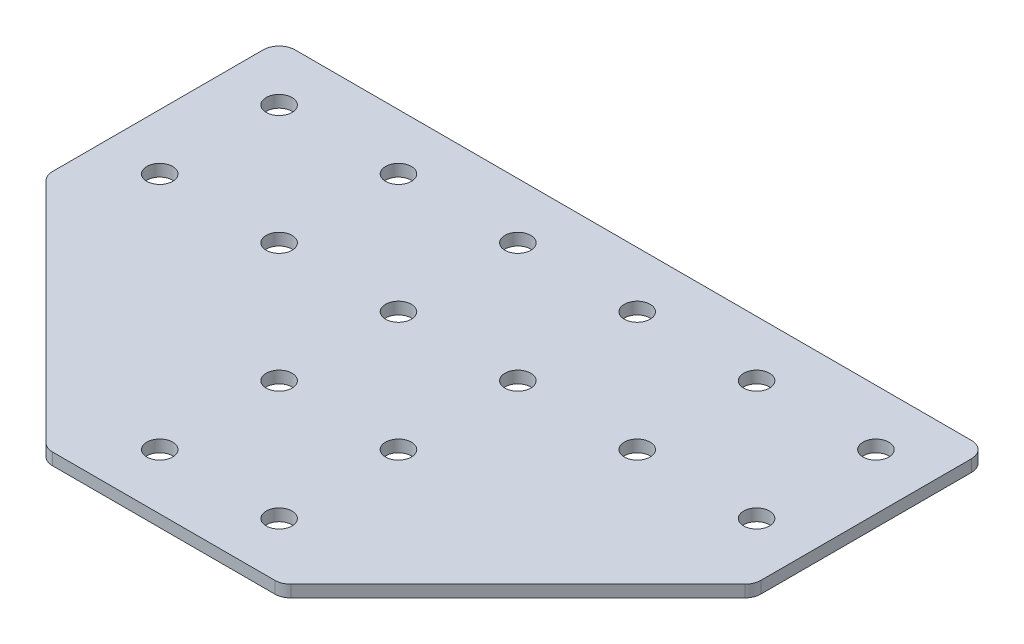
ISO-10303-21;
HEADER;
FILE_DESCRIPTION(('STEP AP214'),'2;1');
FILE_NAME('part.step','',(''),(''),'','','');
FILE_SCHEMA(('AUTOMOTIVE_DESIGN { 1 0 10303 214 1 1 1 1 }'));
ENDSEC;
DATA;
#1=APPLICATION_CONTEXT('core data for automotive mechanical design processes');
#2=APPLICATION_PROTOCOL_DEFINITION('international standard','automotive_design',2000,#1);
#3=PRODUCT_CONTEXT('',#1,'mechanical');
#4=PRODUCT('Part','Part','',(#3));
#5=PRODUCT_RELATED_PRODUCT_CATEGORY('part','',(#4));
#6=PRODUCT_DEFINITION_FORMATION('','',#4);
#7=PRODUCT_DEFINITION_CONTEXT('part definition',#1,'design');
#8=PRODUCT_DEFINITION('design','',#6,#7);
#9=PRODUCT_DEFINITION_SHAPE('','',#8);
#10=(LENGTH_UNIT() NAMED_UNIT(*) SI_UNIT(.MILLI.,.METRE.));
#11=(NAMED_UNIT(*) PLANE_ANGLE_UNIT() SI_UNIT($,.RADIAN.));
#12=(NAMED_UNIT(*) SI_UNIT($,.STERADIAN.) SOLID_ANGLE_UNIT());
#13=UNCERTAINTY_MEASURE_WITH_UNIT(LENGTH_MEASURE(1.E-05),#10,'distance_accuracy_value','');
#14=(GEOMETRIC_REPRESENTATION_CONTEXT(3) GLOBAL_UNCERTAINTY_ASSIGNED_CONTEXT((#13)) GLOBAL_UNIT_ASSIGNED_CONTEXT((#10,
#11,#12)) REPRESENTATION_CONTEXT('',''));
#15=CARTESIAN_POINT('',(0.,0.,0.));
#16=DIRECTION('',(0.,0.,1.));
#17=DIRECTION('',(1.,0.,0.));
#18=AXIS2_PLACEMENT_3D('',#15,#16,#17);
#19=CARTESIAN_POINT('',(-1.34521083117534,1.74134831028641,-16.1457325979904));
#20=DIRECTION('',(0.,-1.,0.));
#21=DIRECTION('',(0.,0.,-1.));
#22=AXIS2_PLACEMENT_3D('',#19,#20,#21);
#23=PLANE('',#22);
#24=DIRECTION('',(1.,0.,0.));
#25=VECTOR('',#24,1.);
#26=CARTESIAN_POINT('',(-15.8452108311755,1.74134831028641,28.3542674020096));
#27=LINE('',#26,#25);
#28=CARTESIAN_POINT('',(-15.3096769252427,1.74134831028641,28.3542674020096));
#29=VERTEX_POINT('',#28);
#30=CARTESIAN_POINT('',(12.619255262892,1.74134831028641,28.3542674020096));
#31=VERTEX_POINT('',#30);
#32=EDGE_CURVE('E218',#29,#31,#27,.T.);
#33=ORIENTED_EDGE('',*,*,#32,.F.);
#34=CARTESIAN_POINT('',(-15.3096769252427,1.74134831028641,26.3542674020096));
#35=DIRECTION('',(0.,1.,0.));
#36=DIRECTION('',(0.,0.,-1.));
#37=AXIS2_PLACEMENT_3D('',#34,#35,#36);
#38=CIRCLE('',#37,2.);
#39=CARTESIAN_POINT('',(-16.7238904876158,1.74134831028641,27.7684809643826));
#40=VERTEX_POINT('',#39);
#41=EDGE_CURVE('E154',#40,#29,#38,.T.);
#42=ORIENTED_EDGE('',*,*,#41,.F.);
#43=DIRECTION('',(-0.707106781186546,0.,-0.707106781186549));
#44=VECTOR('',#43,1.);
#45=CARTESIAN_POINT('',(-16.1381040499889,1.74134831028641,28.3542674020096));
#46=LINE('',#45,#44);
#47=CARTESIAN_POINT('',(-45.2594243935483,1.74134831028641,-0.767052941549988));
#48=VERTEX_POINT('',#47);
#49=EDGE_CURVE('E141',#40,#48,#46,.T.);
#50=ORIENTED_EDGE('',*,*,#49,.T.);
#51=CARTESIAN_POINT('',(-43.8452108311752,1.74134831028641,-2.18126650392308));
#52=DIRECTION('',(0.,1.,0.));
#53=DIRECTION('',(0.,0.,-1.));
#54=AXIS2_PLACEMENT_3D('',#51,#52,#53);
#55=CIRCLE('',#54,2.);
#56=CARTESIAN_POINT('',(-45.8452108311752,1.74134831028641,-2.18126650392308));
#57=VERTEX_POINT('',#56);
#58=EDGE_CURVE('E152',#57,#48,#55,.T.);
#59=ORIENTED_EDGE('',*,*,#58,.F.);
#60=DIRECTION('',(0.,0.,-1.));
#61=VECTOR('',#60,1.);
#62=CARTESIAN_POINT('',(-45.8452108311752,1.74134831028641,-1.3528393791769));
#63=LINE('',#62,#61);
#64=CARTESIAN_POINT('',(-45.8452108311752,1.74134831028641,-28.6457325979904));
#65=VERTEX_POINT('',#64);
#66=EDGE_CURVE('E124',#57,#65,#63,.T.);
#67=ORIENTED_EDGE('',*,*,#66,.T.);
#68=CARTESIAN_POINT('',(-43.8452108311752,1.74134831028641,-28.6457325979904));
#69=DIRECTION('',(0.,1.,0.));
#70=DIRECTION('',(0.,0.,-1.));
#71=AXIS2_PLACEMENT_3D('',#68,#69,#70);
#72=CIRCLE('',#71,2.);
#73=CARTESIAN_POINT('',(-43.8452108311752,1.74134831028641,-30.6457325979904));
#74=VERTEX_POINT('',#73);
#75=EDGE_CURVE('E149',#74,#65,#72,.T.);
#76=ORIENTED_EDGE('',*,*,#75,.F.);
#77=DIRECTION('',(-1.,0.,0.));
#78=VECTOR('',#77,1.);
#79=CARTESIAN_POINT('',(43.1547891688245,1.74134831028641,-30.6457325979904));
#80=LINE('',#79,#78);
#81=CARTESIAN_POINT('',(41.1547891688245,1.74134831028641,-30.6457325979904));
#82=VERTEX_POINT('',#81);
#83=EDGE_CURVE('E215',#82,#74,#80,.T.);
#84=ORIENTED_EDGE('',*,*,#83,.F.);
#85=CARTESIAN_POINT('',(41.1547891688245,1.74134831028641,-28.6457325979904));
#86=DIRECTION('',(0.,-1.,0.));
#87=DIRECTION('',(0.,0.,-1.));
#88=AXIS2_PLACEMENT_3D('',#85,#86,#87);
#89=CIRCLE('',#88,2.);
#90=CARTESIAN_POINT('',(43.1547891688245,1.74134831028641,-28.6457325979904));
#91=VERTEX_POINT('',#90);
#92=EDGE_CURVE('E239',#82,#91,#89,.T.);
#93=ORIENTED_EDGE('',*,*,#92,.T.);
#94=DIRECTION('',(0.,0.,-1.));
#95=VECTOR('',#94,1.);
#96=CARTESIAN_POINT('',(43.1547891688245,1.74134831028641,-1.35283937917691));
#97=LINE('',#96,#95);
#98=CARTESIAN_POINT('',(43.1547891688245,1.74134831028641,-2.18126650392309));
#99=VERTEX_POINT('',#98);
#100=EDGE_CURVE('E212',#99,#91,#97,.T.);
#101=ORIENTED_EDGE('',*,*,#100,.F.);
#102=CARTESIAN_POINT('',(41.1547891688245,1.74134831028641,-2.18126650392309));
#103=DIRECTION('',(0.,-1.,0.));
#104=DIRECTION('',(0.,0.,-1.));
#105=AXIS2_PLACEMENT_3D('',#102,#103,#104);
#106=CIRCLE('',#105,2.);
#107=CARTESIAN_POINT('',(42.5690027311976,1.74134831028641,-0.767052941549998));
#108=VERTEX_POINT('',#107);
#109=EDGE_CURVE('E31',#99,#108,#106,.T.);
#110=ORIENTED_EDGE('',*,*,#109,.T.);
#111=DIRECTION('',(0.707106781186546,0.,-0.707106781186549));
#112=VECTOR('',#111,1.);
#113=CARTESIAN_POINT('',(13.4476823876382,1.74134831028641,28.3542674020096));
#114=LINE('',#113,#112);
#115=CARTESIAN_POINT('',(14.0334688252651,1.74134831028641,27.7684809643826));
#116=VERTEX_POINT('',#115);
#117=EDGE_CURVE('E220',#116,#108,#114,.T.);
#118=ORIENTED_EDGE('',*,*,#117,.F.);
#119=CARTESIAN_POINT('',(12.619255262892,1.74134831028641,26.3542674020096));
#120=DIRECTION('',(0.,-1.,0.));
#121=DIRECTION('',(0.,0.,-1.));
#122=AXIS2_PLACEMENT_3D('',#119,#120,#121);
#123=CIRCLE('',#122,2.);
#124=EDGE_CURVE('E242',#116,#31,#123,.T.);
#125=ORIENTED_EDGE('',*,*,#124,.T.);
#126=EDGE_LOOP('',(#33,#42,#50,#59,#67,#76,#84,#93,#101,#110,#118,#125));
#127=FACE_BOUND('',#126,.T.);
#128=CARTESIAN_POINT('',(36.1547891688246,1.74134831028641,-8.64573259799041));
#129=DIRECTION('',(0.,1.,0.));
#130=DIRECTION('',(0.,0.,1.));
#131=AXIS2_PLACEMENT_3D('',#128,#129,#130);
#132=CIRCLE('',#131,1.625);
#133=CARTESIAN_POINT('',(36.1547891688246,1.74134831028641,-7.02073259799041));
#134=VERTEX_POINT('',#133);
#135=EDGE_CURVE('E164',#134,#134,#132,.T.);
#136=ORIENTED_EDGE('',*,*,#135,.T.);
#137=EDGE_LOOP('',(#136));
#138=FACE_BOUND('',#137,.T.);
#139=CARTESIAN_POINT('',(21.1547891688246,1.74134831028641,-8.64573259799039));
#140=DIRECTION('',(0.,1.,0.));
#141=DIRECTION('',(0.,0.,1.));
#142=AXIS2_PLACEMENT_3D('',#139,#140,#141);
#143=CIRCLE('',#142,1.625);
#144=CARTESIAN_POINT('',(21.1547891688246,1.74134831028641,-7.02073259799039));
#145=VERTEX_POINT('',#144);
#146=EDGE_CURVE('E170',#145,#145,#143,.T.);
#147=ORIENTED_EDGE('',*,*,#146,.T.);
#148=EDGE_LOOP('',(#147));
#149=FACE_BOUND('',#148,.T.);
#150=CARTESIAN_POINT('',(6.15478916882467,1.74134831028641,21.3542674020096));
#151=DIRECTION('',(0.,1.,0.));
#152=DIRECTION('',(0.,0.,1.));
#153=AXIS2_PLACEMENT_3D('',#150,#151,#152);
#154=CIRCLE('',#153,1.625);
#155=CARTESIAN_POINT('',(6.15478916882467,1.74134831028641,22.9792674020096));
#156=VERTEX_POINT('',#155);
#157=EDGE_CURVE('E176',#156,#156,#154,.T.);
#158=ORIENTED_EDGE('',*,*,#157,.T.);
#159=EDGE_LOOP('',(#158));
#160=FACE_BOUND('',#159,.T.);
#161=CARTESIAN_POINT('',(6.15478916882467,1.74134831028641,6.3542674020096));
#162=DIRECTION('',(0.,1.,0.));
#163=DIRECTION('',(0.,0.,1.));
#164=AXIS2_PLACEMENT_3D('',#161,#162,#163);
#165=CIRCLE('',#164,1.625);
#166=CARTESIAN_POINT('',(6.15478916882467,1.74134831028641,7.9792674020096));
#167=VERTEX_POINT('',#166);
#168=EDGE_CURVE('E182',#167,#167,#165,.T.);
#169=ORIENTED_EDGE('',*,*,#168,.T.);
#170=EDGE_LOOP('',(#169));
#171=FACE_BOUND('',#170,.T.);
#172=CARTESIAN_POINT('',(6.15478916882464,1.74134831028641,-8.6457325979904));
#173=DIRECTION('',(0.,1.,0.));
#174=DIRECTION('',(0.,0.,1.));
#175=AXIS2_PLACEMENT_3D('',#172,#173,#174);
#176=CIRCLE('',#175,1.625);
#177=CARTESIAN_POINT('',(6.15478916882464,1.74134831028641,-7.02073259799039));
#178=VERTEX_POINT('',#177);
#179=EDGE_CURVE('E188',#178,#178,#176,.T.);
#180=ORIENTED_EDGE('',*,*,#179,.T.);
#181=EDGE_LOOP('',(#180));
#182=FACE_BOUND('',#181,.T.);
#183=CARTESIAN_POINT('',(36.1547891688246,1.74134831028641,-23.6457325979904));
#184=DIRECTION('',(0.,1.,0.));
#185=DIRECTION('',(0.,0.,1.));
#186=AXIS2_PLACEMENT_3D('',#183,#184,#185);
#187=CIRCLE('',#186,1.625);
#188=CARTESIAN_POINT('',(36.1547891688246,1.74134831028641,-22.0207325979904));
#189=VERTEX_POINT('',#188);
#190=EDGE_CURVE('E194',#189,#189,#187,.T.);
#191=ORIENTED_EDGE('',*,*,#190,.T.);
#192=EDGE_LOOP('',(#191));
#193=FACE_BOUND('',#192,.T.);
#194=CARTESIAN_POINT('',(21.1547891688246,1.74134831028641,-23.6457325979904));
#195=DIRECTION('',(0.,1.,0.));
#196=DIRECTION('',(0.,0.,1.));
#197=AXIS2_PLACEMENT_3D('',#194,#195,#196);
#198=CIRCLE('',#197,1.625);
#199=CARTESIAN_POINT('',(21.1547891688246,1.74134831028641,-22.0207325979904));
#200=VERTEX_POINT('',#199);
#201=EDGE_CURVE('E200',#200,#200,#198,.T.);
#202=ORIENTED_EDGE('',*,*,#201,.T.);
#203=EDGE_LOOP('',(#202));
#204=FACE_BOUND('',#203,.T.);
#205=CARTESIAN_POINT('',(6.15478916882464,1.74134831028641,-23.6457325979904));
#206=DIRECTION('',(0.,1.,0.));
#207=DIRECTION('',(0.,0.,1.));
#208=AXIS2_PLACEMENT_3D('',#205,#206,#207);
#209=CIRCLE('',#208,1.625);
#210=CARTESIAN_POINT('',(6.15478916882464,1.74134831028641,-22.0207325979904));
#211=VERTEX_POINT('',#210);
#212=EDGE_CURVE('E206',#211,#211,#209,.T.);
#213=ORIENTED_EDGE('',*,*,#212,.T.);
#214=EDGE_LOOP('',(#213));
#215=FACE_BOUND('',#214,.T.);
#216=CARTESIAN_POINT('',(-38.8452108311753,1.74134831028641,-8.6457325979904));
#217=DIRECTION('',(0.,-1.,0.));
#218=DIRECTION('',(0.,0.,1.));
#219=AXIS2_PLACEMENT_3D('',#216,#217,#218);
#220=CIRCLE('',#219,1.625);
#221=CARTESIAN_POINT('',(-38.8452108311753,1.74134831028641,-7.0207325979904));
#222=VERTEX_POINT('',#221);
#223=EDGE_CURVE('E318',#222,#222,#220,.T.);
#224=ORIENTED_EDGE('',*,*,#223,.F.);
#225=EDGE_LOOP('',(#224));
#226=FACE_BOUND('',#225,.T.);
#227=CARTESIAN_POINT('',(-23.8452108311753,1.74134831028641,-8.64573259799039));
#228=DIRECTION('',(0.,-1.,0.));
#229=DIRECTION('',(0.,0.,1.));
#230=AXIS2_PLACEMENT_3D('',#227,#228,#229);
#231=CIRCLE('',#230,1.625);
#232=CARTESIAN_POINT('',(-23.8452108311753,1.74134831028641,-7.02073259799039));
#233=VERTEX_POINT('',#232);
#234=EDGE_CURVE('E312',#233,#233,#231,.T.);
#235=ORIENTED_EDGE('',*,*,#234,.F.);
#236=EDGE_LOOP('',(#235));
#237=FACE_BOUND('',#236,.T.);
#238=CARTESIAN_POINT('',(-8.84521083117533,1.74134831028641,21.3542674020096));
#239=DIRECTION('',(0.,-1.,0.));
#240=DIRECTION('',(0.,0.,1.));
#241=AXIS2_PLACEMENT_3D('',#238,#239,#240);
#242=CIRCLE('',#241,1.625);
#243=CARTESIAN_POINT('',(-8.84521083117533,1.74134831028641,22.9792674020096));
#244=VERTEX_POINT('',#243);
#245=EDGE_CURVE('E306',#244,#244,#242,.T.);
#246=ORIENTED_EDGE('',*,*,#245,.F.);
#247=EDGE_LOOP('',(#246));
#248=FACE_BOUND('',#247,.T.);
#249=CARTESIAN_POINT('',(-8.84521083117533,1.74134831028641,6.3542674020096));
#250=DIRECTION('',(0.,-1.,0.));
#251=DIRECTION('',(0.,0.,1.));
#252=AXIS2_PLACEMENT_3D('',#249,#250,#251);
#253=CIRCLE('',#252,1.625);
#254=CARTESIAN_POINT('',(-8.84521083117533,1.74134831028641,7.9792674020096));
#255=VERTEX_POINT('',#254);
#256=EDGE_CURVE('E300',#255,#255,#253,.T.);
#257=ORIENTED_EDGE('',*,*,#256,.F.);
#258=EDGE_LOOP('',(#257));
#259=FACE_BOUND('',#258,.T.);
#260=CARTESIAN_POINT('',(-8.84521083117531,1.74134831028641,-8.64573259799039));
#261=DIRECTION('',(0.,-1.,0.));
#262=DIRECTION('',(0.,0.,1.));
#263=AXIS2_PLACEMENT_3D('',#260,#261,#262);
#264=CIRCLE('',#263,1.625);
#265=CARTESIAN_POINT('',(-8.84521083117531,1.74134831028641,-7.02073259799039));
#266=VERTEX_POINT('',#265);
#267=EDGE_CURVE('E294',#266,#266,#264,.T.);
#268=ORIENTED_EDGE('',*,*,#267,.F.);
#269=EDGE_LOOP('',(#268));
#270=FACE_BOUND('',#269,.T.);
#271=CARTESIAN_POINT('',(-38.8452108311753,1.74134831028641,-23.6457325979904));
#272=DIRECTION('',(0.,-1.,0.));
#273=DIRECTION('',(0.,0.,1.));
#274=AXIS2_PLACEMENT_3D('',#271,#272,#273);
#275=CIRCLE('',#274,1.625);
#276=CARTESIAN_POINT('',(-38.8452108311753,1.74134831028641,-22.0207325979904));
#277=VERTEX_POINT('',#276);
#278=EDGE_CURVE('E288',#277,#277,#275,.T.);
#279=ORIENTED_EDGE('',*,*,#278,.F.);
#280=EDGE_LOOP('',(#279));
#281=FACE_BOUND('',#280,.T.);
#282=CARTESIAN_POINT('',(-23.8452108311753,1.74134831028641,-23.6457325979904));
#283=DIRECTION('',(0.,-1.,0.));
#284=DIRECTION('',(0.,0.,1.));
#285=AXIS2_PLACEMENT_3D('',#282,#283,#284);
#286=CIRCLE('',#285,1.625);
#287=CARTESIAN_POINT('',(-23.8452108311753,1.74134831028641,-22.0207325979904));
#288=VERTEX_POINT('',#287);
#289=EDGE_CURVE('E283',#288,#288,#286,.T.);
#290=ORIENTED_EDGE('',*,*,#289,.F.);
#291=EDGE_LOOP('',(#290));
#292=FACE_BOUND('',#291,.T.);
#293=CARTESIAN_POINT('',(-8.84521083117531,1.74134831028641,-23.6457325979904));
#294=DIRECTION('',(0.,-1.,0.));
#295=DIRECTION('',(0.,0.,1.));
#296=AXIS2_PLACEMENT_3D('',#293,#294,#295);
#297=CIRCLE('',#296,1.625);
#298=CARTESIAN_POINT('',(-8.84521083117531,1.74134831028641,-22.0207325979904));
#299=VERTEX_POINT('',#298);
#300=EDGE_CURVE('E134',#299,#299,#297,.T.);
#301=ORIENTED_EDGE('',*,*,#300,.F.);
#302=EDGE_LOOP('',(#301));
#303=FACE_BOUND('',#302,.T.);
#304=ADVANCED_FACE('F16',(#127,#138,#149,#160,#171,#182,#193,#204,#215,#226,#237,#248,#259,#270,
#281,#292,#303),#23,.T.);
#305=CARTESIAN_POINT('',(43.1547891688245,1.74134831028641,-1.35283937917691));
#306=DIRECTION('',(1.,0.,0.));
#307=DIRECTION('',(0.,0.,-1.));
#308=AXIS2_PLACEMENT_3D('',#305,#306,#307);
#309=PLANE('',#308);
#310=DIRECTION('',(0.,0.,-1.));
#311=VECTOR('',#310,1.);
#312=CARTESIAN_POINT('',(43.1547891688245,3.24134831028641,-1.35283937917691));
#313=LINE('',#312,#311);
#314=CARTESIAN_POINT('',(43.1547891688245,3.24134831028641,-2.18126650392309));
#315=VERTEX_POINT('',#314);
#316=CARTESIAN_POINT('',(43.1547891688245,3.24134831028641,-28.6457325979904));
#317=VERTEX_POINT('',#316);
#318=EDGE_CURVE('E209',#315,#317,#313,.T.);
#319=ORIENTED_EDGE('',*,*,#318,.F.);
#320=DIRECTION('',(0.,1.,0.));
#321=VECTOR('',#320,1.);
#322=CARTESIAN_POINT('',(43.1547891688245,1.74134831028641,-2.18126650392309));
#323=LINE('',#322,#321);
#324=EDGE_CURVE('E24',#315,#99,#323,.F.);
#325=ORIENTED_EDGE('',*,*,#324,.T.);
#326=ORIENTED_EDGE('',*,*,#100,.T.);
#327=DIRECTION('',(0.,1.,0.));
#328=VECTOR('',#327,1.);
#329=CARTESIAN_POINT('',(43.1547891688245,1.74134831028641,-28.6457325979904));
#330=LINE('',#329,#328);
#331=EDGE_CURVE('E249',#91,#317,#330,.T.);
#332=ORIENTED_EDGE('',*,*,#331,.T.);
#333=EDGE_LOOP('',(#319,#325,#326,#332));
#334=FACE_BOUND('',#333,.T.);
#335=ADVANCED_FACE('F254',(#334),#309,.T.);
#336=CARTESIAN_POINT('',(13.4476823876382,1.74134831028641,28.3542674020096));
#337=DIRECTION('',(0.707106781186549,0.,0.707106781186546));
#338=DIRECTION('',(0.707106781186546,0.,-0.707106781186549));
#339=AXIS2_PLACEMENT_3D('',#336,#337,#338);
#340=PLANE('',#339);
#341=DIRECTION('',(0.707106781186546,0.,-0.707106781186549));
#342=VECTOR('',#341,1.);
#343=CARTESIAN_POINT('',(13.4476823876382,3.24134831028641,28.3542674020096));
#344=LINE('',#343,#342);
#345=CARTESIAN_POINT('',(14.0334688252651,3.24134831028641,27.7684809643826));
#346=VERTEX_POINT('',#345);
#347=CARTESIAN_POINT('',(42.5690027311976,3.24134831028641,-0.767052941549998));
#348=VERTEX_POINT('',#347);
#349=EDGE_CURVE('E216',#346,#348,#344,.T.);
#350=ORIENTED_EDGE('',*,*,#349,.F.);
#351=DIRECTION('',(0.,1.,0.));
#352=VECTOR('',#351,1.);
#353=CARTESIAN_POINT('',(14.0334688252651,1.74134831028641,27.7684809643826));
#354=LINE('',#353,#352);
#355=EDGE_CURVE('E38',#346,#116,#354,.F.);
#356=ORIENTED_EDGE('',*,*,#355,.T.);
#357=ORIENTED_EDGE('',*,*,#117,.T.);
#358=DIRECTION('',(0.,1.,0.));
#359=VECTOR('',#358,1.);
#360=CARTESIAN_POINT('',(42.5690027311976,1.74134831028641,-0.767052941549998));
#361=LINE('',#360,#359);
#362=EDGE_CURVE('E245',#108,#348,#361,.T.);
#363=ORIENTED_EDGE('',*,*,#362,.T.);
#364=EDGE_LOOP('',(#350,#356,#357,#363));
#365=FACE_BOUND('',#364,.T.);
#366=ADVANCED_FACE('F262',(#365),#340,.T.);
#367=CARTESIAN_POINT('',(-15.8452108311755,1.74134831028641,28.3542674020096));
#368=DIRECTION('',(0.,0.,1.));
#369=DIRECTION('',(1.,0.,0.));
#370=AXIS2_PLACEMENT_3D('',#367,#368,#369);
#371=PLANE('',#370);
#372=DIRECTION('',(1.,0.,0.));
#373=VECTOR('',#372,1.);
#374=CARTESIAN_POINT('',(-15.8452108311755,3.24134831028641,28.3542674020096));
#375=LINE('',#374,#373);
#376=CARTESIAN_POINT('',(-15.3096769252427,3.24134831028641,28.3542674020096));
#377=VERTEX_POINT('',#376);
#378=CARTESIAN_POINT('',(12.619255262892,3.24134831028641,28.3542674020096));
#379=VERTEX_POINT('',#378);
#380=EDGE_CURVE('E227',#377,#379,#375,.T.);
#381=ORIENTED_EDGE('',*,*,#380,.F.);
#382=DIRECTION('',(0.,1.,0.));
#383=VECTOR('',#382,1.);
#384=CARTESIAN_POINT('',(-15.3096769252427,1.74134831028641,28.3542674020096));
#385=LINE('',#384,#383);
#386=EDGE_CURVE('E146',#29,#377,#385,.T.);
#387=ORIENTED_EDGE('',*,*,#386,.F.);
#388=ORIENTED_EDGE('',*,*,#32,.T.);
#389=DIRECTION('',(0.,1.,0.));
#390=VECTOR('',#389,1.);
#391=CARTESIAN_POINT('',(12.619255262892,1.74134831028641,28.3542674020096));
#392=LINE('',#391,#390);
#393=EDGE_CURVE('E236',#31,#379,#392,.T.);
#394=ORIENTED_EDGE('',*,*,#393,.T.);
#395=EDGE_LOOP('',(#381,#387,#388,#394));
#396=FACE_BOUND('',#395,.T.);
#397=ADVANCED_FACE('F270',(#396),#371,.T.);
#398=CARTESIAN_POINT('',(43.1547891688245,1.74134831028641,-30.6457325979904));
#399=DIRECTION('',(0.,0.,-1.));
#400=DIRECTION('',(-1.,0.,0.));
#401=AXIS2_PLACEMENT_3D('',#398,#399,#400);
#402=PLANE('',#401);
#403=ORIENTED_EDGE('',*,*,#83,.T.);
#404=DIRECTION('',(0.,1.,0.));
#405=VECTOR('',#404,1.);
#406=CARTESIAN_POINT('',(-43.8452108311752,1.74134831028641,-30.6457325979904));
#407=LINE('',#406,#405);
#408=CARTESIAN_POINT('',(-43.8452108311752,3.24134831028641,-30.6457325979904));
#409=VERTEX_POINT('',#408);
#410=EDGE_CURVE('E126',#409,#74,#407,.F.);
#411=ORIENTED_EDGE('',*,*,#410,.F.);
#412=DIRECTION('',(-1.,0.,0.));
#413=VECTOR('',#412,1.);
#414=CARTESIAN_POINT('',(43.1547891688245,3.24134831028641,-30.6457325979904));
#415=LINE('',#414,#413);
#416=CARTESIAN_POINT('',(41.1547891688245,3.24134831028641,-30.6457325979904));
#417=VERTEX_POINT('',#416);
#418=EDGE_CURVE('E225',#417,#409,#415,.T.);
#419=ORIENTED_EDGE('',*,*,#418,.F.);
#420=DIRECTION('',(0.,1.,0.));
#421=VECTOR('',#420,1.);
#422=CARTESIAN_POINT('',(41.1547891688245,1.74134831028641,-30.6457325979904));
#423=LINE('',#422,#421);
#424=EDGE_CURVE('E10',#417,#82,#423,.F.);
#425=ORIENTED_EDGE('',*,*,#424,.T.);
#426=EDGE_LOOP('',(#403,#411,#419,#425));
#427=FACE_BOUND('',#426,.T.);
#428=ADVANCED_FACE('F356',(#427),#402,.T.);
#429=CARTESIAN_POINT('',(-1.34521083117534,3.24134831028641,-16.1457325979904));
#430=DIRECTION('',(0.,-1.,0.));
#431=DIRECTION('',(0.,0.,-1.));
#432=AXIS2_PLACEMENT_3D('',#429,#430,#431);
#433=PLANE('',#432);
#434=CARTESIAN_POINT('',(36.1547891688246,3.24134831028641,-8.64573259799041));
#435=DIRECTION('',(0.,1.,0.));
#436=DIRECTION('',(0.,0.,1.));
#437=AXIS2_PLACEMENT_3D('',#434,#435,#436);
#438=CIRCLE('',#437,1.625);
#439=CARTESIAN_POINT('',(36.1547891688246,3.24134831028641,-7.02073259799041));
#440=VERTEX_POINT('',#439);
#441=EDGE_CURVE('E163',#440,#440,#438,.T.);
#442=ORIENTED_EDGE('',*,*,#441,.F.);
#443=EDGE_LOOP('',(#442));
#444=FACE_BOUND('',#443,.T.);
#445=CARTESIAN_POINT('',(21.1547891688246,3.24134831028641,-8.64573259799039));
#446=DIRECTION('',(0.,1.,0.));
#447=DIRECTION('',(0.,0.,1.));
#448=AXIS2_PLACEMENT_3D('',#445,#446,#447);
#449=CIRCLE('',#448,1.625);
#450=CARTESIAN_POINT('',(21.1547891688246,3.24134831028641,-7.02073259799039));
#451=VERTEX_POINT('',#450);
#452=EDGE_CURVE('E167',#451,#451,#449,.T.);
#453=ORIENTED_EDGE('',*,*,#452,.F.);
#454=EDGE_LOOP('',(#453));
#455=FACE_BOUND('',#454,.T.);
#456=CARTESIAN_POINT('',(6.15478916882467,3.24134831028641,21.3542674020096));
#457=DIRECTION('',(0.,1.,0.));
#458=DIRECTION('',(0.,0.,1.));
#459=AXIS2_PLACEMENT_3D('',#456,#457,#458);
#460=CIRCLE('',#459,1.625);
#461=CARTESIAN_POINT('',(6.15478916882467,3.24134831028641,22.9792674020096));
#462=VERTEX_POINT('',#461);
#463=EDGE_CURVE('E173',#462,#462,#460,.T.);
#464=ORIENTED_EDGE('',*,*,#463,.F.);
#465=EDGE_LOOP('',(#464));
#466=FACE_BOUND('',#465,.T.);
#467=CARTESIAN_POINT('',(6.15478916882467,3.24134831028641,6.3542674020096));
#468=DIRECTION('',(0.,1.,0.));
#469=DIRECTION('',(0.,0.,1.));
#470=AXIS2_PLACEMENT_3D('',#467,#468,#469);
#471=CIRCLE('',#470,1.625);
#472=CARTESIAN_POINT('',(6.15478916882467,3.24134831028641,7.9792674020096));
#473=VERTEX_POINT('',#472);
#474=EDGE_CURVE('E179',#473,#473,#471,.T.);
#475=ORIENTED_EDGE('',*,*,#474,.F.);
#476=EDGE_LOOP('',(#475));
#477=FACE_BOUND('',#476,.T.);
#478=CARTESIAN_POINT('',(6.15478916882464,3.24134831028641,-8.6457325979904));
#479=DIRECTION('',(0.,1.,0.));
#480=DIRECTION('',(0.,0.,1.));
#481=AXIS2_PLACEMENT_3D('',#478,#479,#480);
#482=CIRCLE('',#481,1.625);
#483=CARTESIAN_POINT('',(6.15478916882464,3.24134831028641,-7.02073259799039));
#484=VERTEX_POINT('',#483);
#485=EDGE_CURVE('E185',#484,#484,#482,.T.);
#486=ORIENTED_EDGE('',*,*,#485,.F.);
#487=EDGE_LOOP('',(#486));
#488=FACE_BOUND('',#487,.T.);
#489=CARTESIAN_POINT('',(36.1547891688246,3.24134831028641,-23.6457325979904));
#490=DIRECTION('',(0.,1.,0.));
#491=DIRECTION('',(0.,0.,1.));
#492=AXIS2_PLACEMENT_3D('',#489,#490,#491);
#493=CIRCLE('',#492,1.625);
#494=CARTESIAN_POINT('',(36.1547891688246,3.24134831028641,-22.0207325979904));
#495=VERTEX_POINT('',#494);
#496=EDGE_CURVE('E191',#495,#495,#493,.T.);
#497=ORIENTED_EDGE('',*,*,#496,.F.);
#498=EDGE_LOOP('',(#497));
#499=FACE_BOUND('',#498,.T.);
#500=CARTESIAN_POINT('',(21.1547891688246,3.24134831028641,-23.6457325979904));
#501=DIRECTION('',(0.,1.,0.));
#502=DIRECTION('',(0.,0.,1.));
#503=AXIS2_PLACEMENT_3D('',#500,#501,#502);
#504=CIRCLE('',#503,1.625);
#505=CARTESIAN_POINT('',(21.1547891688246,3.24134831028641,-22.0207325979904));
#506=VERTEX_POINT('',#505);
#507=EDGE_CURVE('E197',#506,#506,#504,.T.);
#508=ORIENTED_EDGE('',*,*,#507,.F.);
#509=EDGE_LOOP('',(#508));
#510=FACE_BOUND('',#509,.T.);
#511=CARTESIAN_POINT('',(6.15478916882464,3.24134831028641,-23.6457325979904));
#512=DIRECTION('',(0.,1.,0.));
#513=DIRECTION('',(0.,0.,1.));
#514=AXIS2_PLACEMENT_3D('',#511,#512,#513);
#515=CIRCLE('',#514,1.625);
#516=CARTESIAN_POINT('',(6.15478916882464,3.24134831028641,-22.0207325979904));
#517=VERTEX_POINT('',#516);
#518=EDGE_CURVE('E203',#517,#517,#515,.T.);
#519=ORIENTED_EDGE('',*,*,#518,.F.);
#520=EDGE_LOOP('',(#519));
#521=FACE_BOUND('',#520,.T.);
#522=ORIENTED_EDGE('',*,*,#418,.T.);
#523=CARTESIAN_POINT('',(-43.8452108311752,3.24134831028641,-28.6457325979904));
#524=DIRECTION('',(0.,1.,0.));
#525=DIRECTION('',(0.,0.,-1.));
#526=AXIS2_PLACEMENT_3D('',#523,#524,#525);
#527=CIRCLE('',#526,2.);
#528=CARTESIAN_POINT('',(-45.8452108311752,3.24134831028641,-28.6457325979904));
#529=VERTEX_POINT('',#528);
#530=EDGE_CURVE('E117',#529,#409,#527,.F.);
#531=ORIENTED_EDGE('',*,*,#530,.F.);
#532=DIRECTION('',(0.,0.,-1.));
#533=VECTOR('',#532,1.);
#534=CARTESIAN_POINT('',(-45.8452108311752,3.24134831028641,-1.3528393791769));
#535=LINE('',#534,#533);
#536=CARTESIAN_POINT('',(-45.8452108311752,3.24134831028641,-2.18126650392308));
#537=VERTEX_POINT('',#536);
#538=EDGE_CURVE('E122',#537,#529,#535,.T.);
#539=ORIENTED_EDGE('',*,*,#538,.F.);
#540=CARTESIAN_POINT('',(-43.8452108311752,3.24134831028641,-2.18126650392308));
#541=DIRECTION('',(0.,1.,0.));
#542=DIRECTION('',(0.,0.,-1.));
#543=AXIS2_PLACEMENT_3D('',#540,#541,#542);
#544=CIRCLE('',#543,2.);
#545=CARTESIAN_POINT('',(-45.2594243935483,3.24134831028641,-0.767052941549988));
#546=VERTEX_POINT('',#545);
#547=EDGE_CURVE('E105',#546,#537,#544,.F.);
#548=ORIENTED_EDGE('',*,*,#547,.F.);
#549=DIRECTION('',(-0.707106781186546,0.,-0.707106781186549));
#550=VECTOR('',#549,1.);
#551=CARTESIAN_POINT('',(-16.1381040499889,3.24134831028641,28.3542674020096));
#552=LINE('',#551,#550);
#553=CARTESIAN_POINT('',(-16.7238904876158,3.24134831028641,27.7684809643826));
#554=VERTEX_POINT('',#553);
#555=EDGE_CURVE('E133',#554,#546,#552,.T.);
#556=ORIENTED_EDGE('',*,*,#555,.F.);
#557=CARTESIAN_POINT('',(-15.3096769252427,3.24134831028641,26.3542674020096));
#558=DIRECTION('',(0.,1.,0.));
#559=DIRECTION('',(0.,0.,-1.));
#560=AXIS2_PLACEMENT_3D('',#557,#558,#559);
#561=CIRCLE('',#560,2.);
#562=EDGE_CURVE('E116',#377,#554,#561,.F.);
#563=ORIENTED_EDGE('',*,*,#562,.F.);
#564=ORIENTED_EDGE('',*,*,#380,.T.);
#565=CARTESIAN_POINT('',(12.619255262892,3.24134831028641,26.3542674020096));
#566=DIRECTION('',(0.,-1.,0.));
#567=DIRECTION('',(0.,0.,-1.));
#568=AXIS2_PLACEMENT_3D('',#565,#566,#567);
#569=CIRCLE('',#568,2.);
#570=EDGE_CURVE('E234',#379,#346,#569,.F.);
#571=ORIENTED_EDGE('',*,*,#570,.T.);
#572=ORIENTED_EDGE('',*,*,#349,.T.);
#573=CARTESIAN_POINT('',(41.1547891688245,3.24134831028641,-2.18126650392309));
#574=DIRECTION('',(0.,-1.,0.));
#575=DIRECTION('',(0.,0.,-1.));
#576=AXIS2_PLACEMENT_3D('',#573,#574,#575);
#577=CIRCLE('',#576,2.);
#578=EDGE_CURVE('E232',#348,#315,#577,.F.);
#579=ORIENTED_EDGE('',*,*,#578,.T.);
#580=ORIENTED_EDGE('',*,*,#318,.T.);
#581=CARTESIAN_POINT('',(41.1547891688245,3.24134831028641,-28.6457325979904));
#582=DIRECTION('',(0.,-1.,0.));
#583=DIRECTION('',(0.,0.,-1.));
#584=AXIS2_PLACEMENT_3D('',#581,#582,#583);
#585=CIRCLE('',#584,2.);
#586=EDGE_CURVE('E222',#317,#417,#585,.F.);
#587=ORIENTED_EDGE('',*,*,#586,.T.);
#588=EDGE_LOOP('',(#522,#531,#539,#548,#556,#563,#564,#571,#572,#579,#580,#587));
#589=FACE_BOUND('',#588,.T.);
#590=CARTESIAN_POINT('',(-38.8452108311753,3.24134831028641,-8.6457325979904));
#591=DIRECTION('',(0.,-1.,0.));
#592=DIRECTION('',(0.,0.,1.));
#593=AXIS2_PLACEMENT_3D('',#590,#591,#592);
#594=CIRCLE('',#593,1.625);
#595=CARTESIAN_POINT('',(-38.8452108311753,3.24134831028641,-7.0207325979904));
#596=VERTEX_POINT('',#595);
#597=EDGE_CURVE('E321',#596,#596,#594,.T.);
#598=ORIENTED_EDGE('',*,*,#597,.T.);
#599=EDGE_LOOP('',(#598));
#600=FACE_BOUND('',#599,.T.);
#601=CARTESIAN_POINT('',(-23.8452108311753,3.24134831028641,-8.64573259799039));
#602=DIRECTION('',(0.,-1.,0.));
#603=DIRECTION('',(0.,0.,1.));
#604=AXIS2_PLACEMENT_3D('',#601,#602,#603);
#605=CIRCLE('',#604,1.625);
#606=CARTESIAN_POINT('',(-23.8452108311753,3.24134831028641,-7.02073259799039));
#607=VERTEX_POINT('',#606);
#608=EDGE_CURVE('E315',#607,#607,#605,.T.);
#609=ORIENTED_EDGE('',*,*,#608,.T.);
#610=EDGE_LOOP('',(#609));
#611=FACE_BOUND('',#610,.T.);
#612=CARTESIAN_POINT('',(-8.84521083117533,3.24134831028641,21.3542674020096));
#613=DIRECTION('',(0.,-1.,0.));
#614=DIRECTION('',(0.,0.,1.));
#615=AXIS2_PLACEMENT_3D('',#612,#613,#614);
#616=CIRCLE('',#615,1.625);
#617=CARTESIAN_POINT('',(-8.84521083117533,3.24134831028641,22.9792674020096));
#618=VERTEX_POINT('',#617);
#619=EDGE_CURVE('E309',#618,#618,#616,.T.);
#620=ORIENTED_EDGE('',*,*,#619,.T.);
#621=EDGE_LOOP('',(#620));
#622=FACE_BOUND('',#621,.T.);
#623=CARTESIAN_POINT('',(-8.84521083117533,3.24134831028641,6.3542674020096));
#624=DIRECTION('',(0.,-1.,0.));
#625=DIRECTION('',(0.,0.,1.));
#626=AXIS2_PLACEMENT_3D('',#623,#624,#625);
#627=CIRCLE('',#626,1.625);
#628=CARTESIAN_POINT('',(-8.84521083117533,3.24134831028641,7.9792674020096));
#629=VERTEX_POINT('',#628);
#630=EDGE_CURVE('E303',#629,#629,#627,.T.);
#631=ORIENTED_EDGE('',*,*,#630,.T.);
#632=EDGE_LOOP('',(#631));
#633=FACE_BOUND('',#632,.T.);
#634=CARTESIAN_POINT('',(-8.84521083117531,3.24134831028641,-8.64573259799039));
#635=DIRECTION('',(0.,-1.,0.));
#636=DIRECTION('',(0.,0.,1.));
#637=AXIS2_PLACEMENT_3D('',#634,#635,#636);
#638=CIRCLE('',#637,1.625);
#639=CARTESIAN_POINT('',(-8.84521083117531,3.24134831028641,-7.02073259799039));
#640=VERTEX_POINT('',#639);
#641=EDGE_CURVE('E297',#640,#640,#638,.T.);
#642=ORIENTED_EDGE('',*,*,#641,.T.);
#643=EDGE_LOOP('',(#642));
#644=FACE_BOUND('',#643,.T.);
#645=CARTESIAN_POINT('',(-38.8452108311753,3.24134831028641,-23.6457325979904));
#646=DIRECTION('',(0.,-1.,0.));
#647=DIRECTION('',(0.,0.,1.));
#648=AXIS2_PLACEMENT_3D('',#645,#646,#647);
#649=CIRCLE('',#648,1.625);
#650=CARTESIAN_POINT('',(-38.8452108311753,3.24134831028641,-22.0207325979904));
#651=VERTEX_POINT('',#650);
#652=EDGE_CURVE('E291',#651,#651,#649,.T.);
#653=ORIENTED_EDGE('',*,*,#652,.T.);
#654=EDGE_LOOP('',(#653));
#655=FACE_BOUND('',#654,.T.);
#656=CARTESIAN_POINT('',(-23.8452108311753,3.24134831028641,-23.6457325979904));
#657=DIRECTION('',(0.,-1.,0.));
#658=DIRECTION('',(0.,0.,1.));
#659=AXIS2_PLACEMENT_3D('',#656,#657,#658);
#660=CIRCLE('',#659,1.625);
#661=CARTESIAN_POINT('',(-23.8452108311753,3.24134831028641,-22.0207325979904));
#662=VERTEX_POINT('',#661);
#663=EDGE_CURVE('E285',#662,#662,#660,.T.);
#664=ORIENTED_EDGE('',*,*,#663,.T.);
#665=EDGE_LOOP('',(#664));
#666=FACE_BOUND('',#665,.T.);
#667=CARTESIAN_POINT('',(-8.84521083117531,3.24134831028641,-23.6457325979904));
#668=DIRECTION('',(0.,-1.,0.));
#669=DIRECTION('',(0.,0.,1.));
#670=AXIS2_PLACEMENT_3D('',#667,#668,#669);
#671=CIRCLE('',#670,1.625);
#672=CARTESIAN_POINT('',(-8.84521083117531,3.24134831028641,-22.0207325979904));
#673=VERTEX_POINT('',#672);
#674=EDGE_CURVE('E138',#673,#673,#671,.T.);
#675=ORIENTED_EDGE('',*,*,#674,.T.);
#676=EDGE_LOOP('',(#675));
#677=FACE_BOUND('',#676,.T.);
#678=ADVANCED_FACE('F129',(#444,#455,#466,#477,#488,#499,#510,#521,#589,#600,#611,#622,#633,
#644,#655,#666,#677),#433,.F.);
#679=CARTESIAN_POINT('',(12.619255262892,1.74134831028641,26.3542674020096));
#680=DIRECTION('',(0.,1.,0.));
#681=DIRECTION('',(0.,0.,1.));
#682=AXIS2_PLACEMENT_3D('',#679,#680,#681);
#683=CYLINDRICAL_SURFACE('',#682,2.);
#684=ORIENTED_EDGE('',*,*,#124,.F.);
#685=ORIENTED_EDGE('',*,*,#355,.F.);
#686=ORIENTED_EDGE('',*,*,#570,.F.);
#687=ORIENTED_EDGE('',*,*,#393,.F.);
#688=EDGE_LOOP('',(#684,#685,#686,#687));
#689=FACE_BOUND('',#688,.T.);
#690=ADVANCED_FACE('F268',(#689),#683,.T.);
#691=CARTESIAN_POINT('',(41.1547891688245,1.74134831028641,-2.18126650392309));
#692=DIRECTION('',(0.,1.,0.));
#693=DIRECTION('',(0.,0.,1.));
#694=AXIS2_PLACEMENT_3D('',#691,#692,#693);
#695=CYLINDRICAL_SURFACE('',#694,2.);
#696=ORIENTED_EDGE('',*,*,#109,.F.);
#697=ORIENTED_EDGE('',*,*,#324,.F.);
#698=ORIENTED_EDGE('',*,*,#578,.F.);
#699=ORIENTED_EDGE('',*,*,#362,.F.);
#700=EDGE_LOOP('',(#696,#697,#698,#699));
#701=FACE_BOUND('',#700,.T.);
#702=ADVANCED_FACE('F261',(#701),#695,.T.);
#703=CARTESIAN_POINT('',(41.1547891688245,1.74134831028641,-28.6457325979904));
#704=DIRECTION('',(0.,1.,0.));
#705=DIRECTION('',(0.,0.,1.));
#706=AXIS2_PLACEMENT_3D('',#703,#704,#705);
#707=CYLINDRICAL_SURFACE('',#706,2.);
#708=ORIENTED_EDGE('',*,*,#92,.F.);
#709=ORIENTED_EDGE('',*,*,#424,.F.);
#710=ORIENTED_EDGE('',*,*,#586,.F.);
#711=ORIENTED_EDGE('',*,*,#331,.F.);
#712=EDGE_LOOP('',(#708,#709,#710,#711));
#713=FACE_BOUND('',#712,.T.);
#714=ADVANCED_FACE('F18',(#713),#707,.T.);
#715=CARTESIAN_POINT('',(6.15478916882464,1.74134831028641,-23.6457325979904));
#716=DIRECTION('',(0.,1.,0.));
#717=DIRECTION('',(0.,0.,1.));
#718=AXIS2_PLACEMENT_3D('',#715,#716,#717);
#719=CYLINDRICAL_SURFACE('',#718,1.625);
#720=ORIENTED_EDGE('',*,*,#212,.F.);
#721=EDGE_LOOP('',(#720));
#722=FACE_BOUND('',#721,.T.);
#723=ORIENTED_EDGE('',*,*,#518,.T.);
#724=EDGE_LOOP('',(#723));
#725=FACE_BOUND('',#724,.T.);
#726=ADVANCED_FACE('F374',(#722,#725),#719,.F.);
#727=CARTESIAN_POINT('',(21.1547891688246,1.74134831028641,-23.6457325979904));
#728=DIRECTION('',(0.,1.,0.));
#729=DIRECTION('',(0.,0.,1.));
#730=AXIS2_PLACEMENT_3D('',#727,#728,#729);
#731=CYLINDRICAL_SURFACE('',#730,1.625);
#732=ORIENTED_EDGE('',*,*,#201,.F.);
#733=EDGE_LOOP('',(#732));
#734=FACE_BOUND('',#733,.T.);
#735=ORIENTED_EDGE('',*,*,#507,.T.);
#736=EDGE_LOOP('',(#735));
#737=FACE_BOUND('',#736,.T.);
#738=ADVANCED_FACE('F379',(#734,#737),#731,.F.);
#739=CARTESIAN_POINT('',(36.1547891688246,1.74134831028641,-23.6457325979904));
#740=DIRECTION('',(0.,1.,0.));
#741=DIRECTION('',(0.,0.,1.));
#742=AXIS2_PLACEMENT_3D('',#739,#740,#741);
#743=CYLINDRICAL_SURFACE('',#742,1.625);
#744=ORIENTED_EDGE('',*,*,#190,.F.);
#745=EDGE_LOOP('',(#744));
#746=FACE_BOUND('',#745,.T.);
#747=ORIENTED_EDGE('',*,*,#496,.T.);
#748=EDGE_LOOP('',(#747));
#749=FACE_BOUND('',#748,.T.);
#750=ADVANCED_FACE('F413',(#746,#749),#743,.F.);
#751=CARTESIAN_POINT('',(6.15478916882464,1.74134831028641,-8.6457325979904));
#752=DIRECTION('',(0.,1.,0.));
#753=DIRECTION('',(0.,0.,1.));
#754=AXIS2_PLACEMENT_3D('',#751,#752,#753);
#755=CYLINDRICAL_SURFACE('',#754,1.625);
#756=ORIENTED_EDGE('',*,*,#179,.F.);
#757=EDGE_LOOP('',(#756));
#758=FACE_BOUND('',#757,.T.);
#759=ORIENTED_EDGE('',*,*,#485,.T.);
#760=EDGE_LOOP('',(#759));
#761=FACE_BOUND('',#760,.T.);
#762=ADVANCED_FACE('F409',(#758,#761),#755,.F.);
#763=CARTESIAN_POINT('',(6.15478916882467,1.74134831028641,6.3542674020096));
#764=DIRECTION('',(0.,1.,0.));
#765=DIRECTION('',(0.,0.,1.));
#766=AXIS2_PLACEMENT_3D('',#763,#764,#765);
#767=CYLINDRICAL_SURFACE('',#766,1.625);
#768=ORIENTED_EDGE('',*,*,#168,.F.);
#769=EDGE_LOOP('',(#768));
#770=FACE_BOUND('',#769,.T.);
#771=ORIENTED_EDGE('',*,*,#474,.T.);
#772=EDGE_LOOP('',(#771));
#773=FACE_BOUND('',#772,.T.);
#774=ADVANCED_FACE('F405',(#770,#773),#767,.F.);
#775=CARTESIAN_POINT('',(6.15478916882467,1.74134831028641,21.3542674020096));
#776=DIRECTION('',(0.,1.,0.));
#777=DIRECTION('',(0.,0.,1.));
#778=AXIS2_PLACEMENT_3D('',#775,#776,#777);
#779=CYLINDRICAL_SURFACE('',#778,1.625);
#780=ORIENTED_EDGE('',*,*,#157,.F.);
#781=EDGE_LOOP('',(#780));
#782=FACE_BOUND('',#781,.T.);
#783=ORIENTED_EDGE('',*,*,#463,.T.);
#784=EDGE_LOOP('',(#783));
#785=FACE_BOUND('',#784,.T.);
#786=ADVANCED_FACE('F401',(#782,#785),#779,.F.);
#787=CARTESIAN_POINT('',(21.1547891688246,1.74134831028641,-8.64573259799039));
#788=DIRECTION('',(0.,1.,0.));
#789=DIRECTION('',(0.,0.,1.));
#790=AXIS2_PLACEMENT_3D('',#787,#788,#789);
#791=CYLINDRICAL_SURFACE('',#790,1.625);
#792=ORIENTED_EDGE('',*,*,#146,.F.);
#793=EDGE_LOOP('',(#792));
#794=FACE_BOUND('',#793,.T.);
#795=ORIENTED_EDGE('',*,*,#452,.T.);
#796=EDGE_LOOP('',(#795));
#797=FACE_BOUND('',#796,.T.);
#798=ADVANCED_FACE('F397',(#794,#797),#791,.F.);
#799=CARTESIAN_POINT('',(36.1547891688246,1.74134831028641,-8.64573259799041));
#800=DIRECTION('',(0.,1.,0.));
#801=DIRECTION('',(0.,0.,1.));
#802=AXIS2_PLACEMENT_3D('',#799,#800,#801);
#803=CYLINDRICAL_SURFACE('',#802,1.625);
#804=ORIENTED_EDGE('',*,*,#135,.F.);
#805=EDGE_LOOP('',(#804));
#806=FACE_BOUND('',#805,.T.);
#807=ORIENTED_EDGE('',*,*,#441,.T.);
#808=EDGE_LOOP('',(#807));
#809=FACE_BOUND('',#808,.T.);
#810=ADVANCED_FACE('F394',(#806,#809),#803,.F.);
#811=CARTESIAN_POINT('',(-45.8452108311752,1.74134831028641,-1.3528393791769));
#812=DIRECTION('',(-1.,0.,0.));
#813=DIRECTION('',(0.,0.,-1.));
#814=AXIS2_PLACEMENT_3D('',#811,#812,#813);
#815=PLANE('',#814);
#816=ORIENTED_EDGE('',*,*,#538,.T.);
#817=DIRECTION('',(0.,1.,0.));
#818=VECTOR('',#817,1.);
#819=CARTESIAN_POINT('',(-45.8452108311752,1.74134831028641,-28.6457325979904));
#820=LINE('',#819,#818);
#821=EDGE_CURVE('E127',#65,#529,#820,.T.);
#822=ORIENTED_EDGE('',*,*,#821,.F.);
#823=ORIENTED_EDGE('',*,*,#66,.F.);
#824=DIRECTION('',(0.,1.,0.));
#825=VECTOR('',#824,1.);
#826=CARTESIAN_POINT('',(-45.8452108311752,1.74134831028641,-2.18126650392308));
#827=LINE('',#826,#825);
#828=EDGE_CURVE('E109',#537,#57,#827,.F.);
#829=ORIENTED_EDGE('',*,*,#828,.F.);
#830=EDGE_LOOP('',(#816,#822,#823,#829));
#831=FACE_BOUND('',#830,.T.);
#832=ADVANCED_FACE('F121',(#831),#815,.T.);
#833=CARTESIAN_POINT('',(-16.1381040499889,1.74134831028641,28.3542674020096));
#834=DIRECTION('',(-0.707106781186549,0.,0.707106781186546));
#835=DIRECTION('',(-0.707106781186546,0.,-0.707106781186549));
#836=AXIS2_PLACEMENT_3D('',#833,#834,#835);
#837=PLANE('',#836);
#838=ORIENTED_EDGE('',*,*,#555,.T.);
#839=DIRECTION('',(0.,1.,0.));
#840=VECTOR('',#839,1.);
#841=CARTESIAN_POINT('',(-45.2594243935483,1.74134831028641,-0.767052941549988));
#842=LINE('',#841,#840);
#843=EDGE_CURVE('E111',#48,#546,#842,.T.);
#844=ORIENTED_EDGE('',*,*,#843,.F.);
#845=ORIENTED_EDGE('',*,*,#49,.F.);
#846=DIRECTION('',(0.,1.,0.));
#847=VECTOR('',#846,1.);
#848=CARTESIAN_POINT('',(-16.7238904876158,1.74134831028641,27.7684809643826));
#849=LINE('',#848,#847);
#850=EDGE_CURVE('E158',#554,#40,#849,.F.);
#851=ORIENTED_EDGE('',*,*,#850,.F.);
#852=EDGE_LOOP('',(#838,#844,#845,#851));
#853=FACE_BOUND('',#852,.T.);
#854=ADVANCED_FACE('F279',(#853),#837,.T.);
#855=CARTESIAN_POINT('',(-15.3096769252427,1.74134831028641,26.3542674020096));
#856=DIRECTION('',(0.,1.,0.));
#857=DIRECTION('',(0.,0.,1.));
#858=AXIS2_PLACEMENT_3D('',#855,#856,#857);
#859=CYLINDRICAL_SURFACE('',#858,2.);
#860=ORIENTED_EDGE('',*,*,#41,.T.);
#861=ORIENTED_EDGE('',*,*,#386,.T.);
#862=ORIENTED_EDGE('',*,*,#562,.T.);
#863=ORIENTED_EDGE('',*,*,#850,.T.);
#864=EDGE_LOOP('',(#860,#861,#862,#863));
#865=FACE_BOUND('',#864,.T.);
#866=ADVANCED_FACE('F276',(#865),#859,.T.);
#867=CARTESIAN_POINT('',(-43.8452108311752,1.74134831028641,-2.18126650392308));
#868=DIRECTION('',(0.,1.,0.));
#869=DIRECTION('',(0.,0.,1.));
#870=AXIS2_PLACEMENT_3D('',#867,#868,#869);
#871=CYLINDRICAL_SURFACE('',#870,2.);
#872=ORIENTED_EDGE('',*,*,#58,.T.);
#873=ORIENTED_EDGE('',*,*,#843,.T.);
#874=ORIENTED_EDGE('',*,*,#547,.T.);
#875=ORIENTED_EDGE('',*,*,#828,.T.);
#876=EDGE_LOOP('',(#872,#873,#874,#875));
#877=FACE_BOUND('',#876,.T.);
#878=ADVANCED_FACE('F108',(#877),#871,.T.);
#879=CARTESIAN_POINT('',(-43.8452108311752,1.74134831028641,-28.6457325979904));
#880=DIRECTION('',(0.,1.,0.));
#881=DIRECTION('',(0.,0.,1.));
#882=AXIS2_PLACEMENT_3D('',#879,#880,#881);
#883=CYLINDRICAL_SURFACE('',#882,2.);
#884=ORIENTED_EDGE('',*,*,#75,.T.);
#885=ORIENTED_EDGE('',*,*,#821,.T.);
#886=ORIENTED_EDGE('',*,*,#530,.T.);
#887=ORIENTED_EDGE('',*,*,#410,.T.);
#888=EDGE_LOOP('',(#884,#885,#886,#887));
#889=FACE_BOUND('',#888,.T.);
#890=ADVANCED_FACE('F351',(#889),#883,.T.);
#891=CARTESIAN_POINT('',(-8.84521083117531,1.74134831028641,-23.6457325979904));
#892=DIRECTION('',(0.,1.,0.));
#893=DIRECTION('',(0.,0.,1.));
#894=AXIS2_PLACEMENT_3D('',#891,#892,#893);
#895=CYLINDRICAL_SURFACE('',#894,1.625);
#896=ORIENTED_EDGE('',*,*,#300,.T.);
#897=EDGE_LOOP('',(#896));
#898=FACE_BOUND('',#897,.T.);
#899=ORIENTED_EDGE('',*,*,#674,.F.);
#900=EDGE_LOOP('',(#899));
#901=FACE_BOUND('',#900,.T.);
#902=ADVANCED_FACE('F347',(#898,#901),#895,.F.);
#903=CARTESIAN_POINT('',(-23.8452108311753,1.74134831028641,-23.6457325979904));
#904=DIRECTION('',(0.,1.,0.));
#905=DIRECTION('',(0.,0.,1.));
#906=AXIS2_PLACEMENT_3D('',#903,#904,#905);
#907=CYLINDRICAL_SURFACE('',#906,1.625);
#908=ORIENTED_EDGE('',*,*,#289,.T.);
#909=EDGE_LOOP('',(#908));
#910=FACE_BOUND('',#909,.T.);
#911=ORIENTED_EDGE('',*,*,#663,.F.);
#912=EDGE_LOOP('',(#911));
#913=FACE_BOUND('',#912,.T.);
#914=ADVANCED_FACE('F350',(#910,#913),#907,.F.);
#915=CARTESIAN_POINT('',(-38.8452108311753,1.74134831028641,-23.6457325979904));
#916=DIRECTION('',(0.,1.,0.));
#917=DIRECTION('',(0.,0.,1.));
#918=AXIS2_PLACEMENT_3D('',#915,#916,#917);
#919=CYLINDRICAL_SURFACE('',#918,1.625);
#920=ORIENTED_EDGE('',*,*,#278,.T.);
#921=EDGE_LOOP('',(#920));
#922=FACE_BOUND('',#921,.T.);
#923=ORIENTED_EDGE('',*,*,#652,.F.);
#924=EDGE_LOOP('',(#923));
#925=FACE_BOUND('',#924,.T.);
#926=ADVANCED_FACE('F552',(#922,#925),#919,.F.);
#927=CARTESIAN_POINT('',(-8.84521083117531,1.74134831028641,-8.64573259799039));
#928=DIRECTION('',(0.,1.,0.));
#929=DIRECTION('',(0.,0.,1.));
#930=AXIS2_PLACEMENT_3D('',#927,#928,#929);
#931=CYLINDRICAL_SURFACE('',#930,1.625);
#932=ORIENTED_EDGE('',*,*,#267,.T.);
#933=EDGE_LOOP('',(#932));
#934=FACE_BOUND('',#933,.T.);
#935=ORIENTED_EDGE('',*,*,#641,.F.);
#936=EDGE_LOOP('',(#935));
#937=FACE_BOUND('',#936,.T.);
#938=ADVANCED_FACE('F562',(#934,#937),#931,.F.);
#939=CARTESIAN_POINT('',(-8.84521083117533,1.74134831028641,6.3542674020096));
#940=DIRECTION('',(0.,1.,0.));
#941=DIRECTION('',(0.,0.,1.));
#942=AXIS2_PLACEMENT_3D('',#939,#940,#941);
#943=CYLINDRICAL_SURFACE('',#942,1.625);
#944=ORIENTED_EDGE('',*,*,#256,.T.);
#945=EDGE_LOOP('',(#944));
#946=FACE_BOUND('',#945,.T.);
#947=ORIENTED_EDGE('',*,*,#630,.F.);
#948=EDGE_LOOP('',(#947));
#949=FACE_BOUND('',#948,.T.);
#950=ADVANCED_FACE('F572',(#946,#949),#943,.F.);
#951=CARTESIAN_POINT('',(-8.84521083117533,1.74134831028641,21.3542674020096));
#952=DIRECTION('',(0.,1.,0.));
#953=DIRECTION('',(0.,0.,1.));
#954=AXIS2_PLACEMENT_3D('',#951,#952,#953);
#955=CYLINDRICAL_SURFACE('',#954,1.625);
#956=ORIENTED_EDGE('',*,*,#245,.T.);
#957=EDGE_LOOP('',(#956));
#958=FACE_BOUND('',#957,.T.);
#959=ORIENTED_EDGE('',*,*,#619,.F.);
#960=EDGE_LOOP('',(#959));
#961=FACE_BOUND('',#960,.T.);
#962=ADVANCED_FACE('F582',(#958,#961),#955,.F.);
#963=CARTESIAN_POINT('',(-23.8452108311753,1.74134831028641,-8.64573259799039));
#964=DIRECTION('',(0.,1.,0.));
#965=DIRECTION('',(0.,0.,1.));
#966=AXIS2_PLACEMENT_3D('',#963,#964,#965);
#967=CYLINDRICAL_SURFACE('',#966,1.625);
#968=ORIENTED_EDGE('',*,*,#234,.T.);
#969=EDGE_LOOP('',(#968));
#970=FACE_BOUND('',#969,.T.);
#971=ORIENTED_EDGE('',*,*,#608,.F.);
#972=EDGE_LOOP('',(#971));
#973=FACE_BOUND('',#972,.T.);
#974=ADVANCED_FACE('F592',(#970,#973),#967,.F.);
#975=CARTESIAN_POINT('',(-38.8452108311753,1.74134831028641,-8.6457325979904));
#976=DIRECTION('',(0.,1.,0.));
#977=DIRECTION('',(0.,0.,1.));
#978=AXIS2_PLACEMENT_3D('',#975,#976,#977);
#979=CYLINDRICAL_SURFACE('',#978,1.625);
#980=ORIENTED_EDGE('',*,*,#223,.T.);
#981=EDGE_LOOP('',(#980));
#982=FACE_BOUND('',#981,.T.);
#983=ORIENTED_EDGE('',*,*,#597,.F.);
#984=EDGE_LOOP('',(#983));
#985=FACE_BOUND('',#984,.T.);
#986=ADVANCED_FACE('F327',(#982,#985),#979,.F.);
#987=CLOSED_SHELL('',(#304,#335,#366,#397,#428,#678,#690,#702,#714,#726,#738,#750,#762,#774,
#786,#798,#810,#832,#854,#866,#878,#890,#902,#914,#926,#938,#950,#962,#974,#986));
#988=MANIFOLD_SOLID_BREP('B1',#987);
#989=ADVANCED_BREP_SHAPE_REPRESENTATION('',(#18,#988),#14);
#990=SHAPE_DEFINITION_REPRESENTATION(#9,#989);
ENDSEC;
END-ISO-10303-21;
